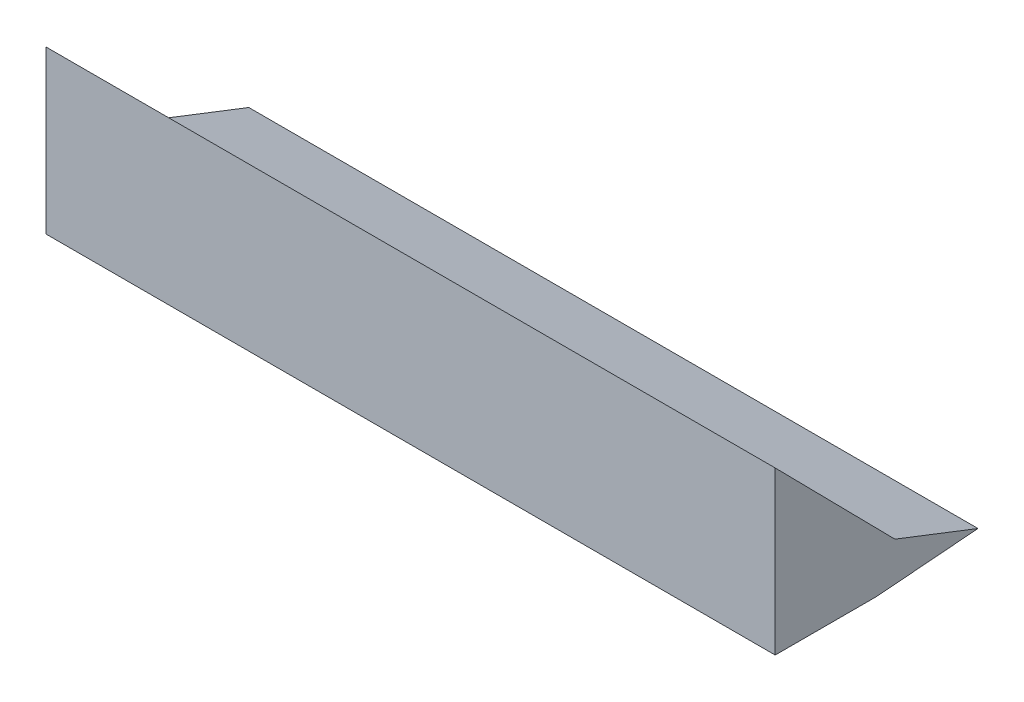
ISO-10303-21;
HEADER;
FILE_DESCRIPTION(('STEP AP214'),'2;1');
FILE_NAME('part.step','',(''),(''),'','','');
FILE_SCHEMA(('AUTOMOTIVE_DESIGN { 1 0 10303 214 1 1 1 1 }'));
ENDSEC;
DATA;
#1=APPLICATION_CONTEXT('core data for automotive mechanical design processes');
#2=APPLICATION_PROTOCOL_DEFINITION('international standard','automotive_design',2000,#1);
#3=PRODUCT_CONTEXT('',#1,'mechanical');
#4=PRODUCT('Part','Part','',(#3));
#5=PRODUCT_RELATED_PRODUCT_CATEGORY('part','',(#4));
#6=PRODUCT_DEFINITION_FORMATION('','',#4);
#7=PRODUCT_DEFINITION_CONTEXT('part definition',#1,'design');
#8=PRODUCT_DEFINITION('design','',#6,#7);
#9=PRODUCT_DEFINITION_SHAPE('','',#8);
#10=(LENGTH_UNIT() NAMED_UNIT(*) SI_UNIT(.MILLI.,.METRE.));
#11=(NAMED_UNIT(*) PLANE_ANGLE_UNIT() SI_UNIT($,.RADIAN.));
#12=(NAMED_UNIT(*) SI_UNIT($,.STERADIAN.) SOLID_ANGLE_UNIT());
#13=UNCERTAINTY_MEASURE_WITH_UNIT(LENGTH_MEASURE(1.E-05),#10,'distance_accuracy_value','');
#14=(GEOMETRIC_REPRESENTATION_CONTEXT(3) GLOBAL_UNCERTAINTY_ASSIGNED_CONTEXT((#13)) GLOBAL_UNIT_ASSIGNED_CONTEXT((#10,
#11,#12)) REPRESENTATION_CONTEXT('',''));
#15=CARTESIAN_POINT('',(0.,0.,0.));
#16=DIRECTION('',(0.,0.,1.));
#17=DIRECTION('',(1.,0.,0.));
#18=AXIS2_PLACEMENT_3D('',#15,#16,#17);
#19=CARTESIAN_POINT('',(180.,10.,-29.5554481427807));
#20=DIRECTION('',(0.,-0.701809028359898,0.712365136508333));
#21=DIRECTION('',(0.,-0.712365136508333,-0.701809028359898));
#22=AXIS2_PLACEMENT_3D('',#19,#20,#21);
#23=PLANE('',#22);
#24=DIRECTION('',(0.,0.712365136508333,0.701809028359898));
#25=VECTOR('',#24,1.);
#26=CARTESIAN_POINT('',(0.,10.,-29.5554481427807));
#27=LINE('',#26,#25);
#28=CARTESIAN_POINT('',(0.,10.,-29.5554481427807));
#29=VERTEX_POINT('',#28);
#30=CARTESIAN_POINT('',(0.,40.,0.));
#31=VERTEX_POINT('',#30);
#32=EDGE_CURVE('E122',#29,#31,#27,.T.);
#33=ORIENTED_EDGE('',*,*,#32,.T.);
#34=DIRECTION('',(-1.,0.,0.));
#35=VECTOR('',#34,1.);
#36=CARTESIAN_POINT('',(180.,40.,0.));
#37=LINE('',#36,#35);
#38=CARTESIAN_POINT('',(180.,40.,0.));
#39=VERTEX_POINT('',#38);
#40=EDGE_CURVE('E11',#39,#31,#37,.T.);
#41=ORIENTED_EDGE('',*,*,#40,.F.);
#42=DIRECTION('',(0.,0.712365136508333,0.701809028359898));
#43=VECTOR('',#42,1.);
#44=CARTESIAN_POINT('',(180.,10.,-29.5554481427807));
#45=LINE('',#44,#43);
#46=CARTESIAN_POINT('',(180.,10.,-29.5554481427807));
#47=VERTEX_POINT('',#46);
#48=EDGE_CURVE('E135',#47,#39,#45,.T.);
#49=ORIENTED_EDGE('',*,*,#48,.F.);
#50=DIRECTION('',(-1.,0.,0.));
#51=VECTOR('',#50,1.);
#52=CARTESIAN_POINT('',(180.,10.,-29.5554481427807));
#53=LINE('',#52,#51);
#54=EDGE_CURVE('E118',#47,#29,#53,.T.);
#55=ORIENTED_EDGE('',*,*,#54,.T.);
#56=EDGE_LOOP('',(#33,#41,#49,#55));
#57=FACE_BOUND('',#56,.T.);
#58=ADVANCED_FACE('F43',(#57),#23,.F.);
#59=CARTESIAN_POINT('',(180.,0.,0.));
#60=DIRECTION('',(0.,0.,-1.));
#61=DIRECTION('',(-1.,0.,0.));
#62=AXIS2_PLACEMENT_3D('',#59,#60,#61);
#63=PLANE('',#62);
#64=DIRECTION('',(0.,-1.,0.));
#65=VECTOR('',#64,1.);
#66=CARTESIAN_POINT('',(0.,0.,0.));
#67=LINE('',#66,#65);
#68=CARTESIAN_POINT('',(0.,0.,0.));
#69=VERTEX_POINT('',#68);
#70=EDGE_CURVE('E126',#31,#69,#67,.T.);
#71=ORIENTED_EDGE('',*,*,#70,.T.);
#72=DIRECTION('',(-1.,0.,0.));
#73=VECTOR('',#72,1.);
#74=CARTESIAN_POINT('',(180.,0.,0.));
#75=LINE('',#74,#73);
#76=CARTESIAN_POINT('',(180.,0.,0.));
#77=VERTEX_POINT('',#76);
#78=EDGE_CURVE('E52',#77,#69,#75,.T.);
#79=ORIENTED_EDGE('',*,*,#78,.F.);
#80=DIRECTION('',(0.,-1.,0.));
#81=VECTOR('',#80,1.);
#82=CARTESIAN_POINT('',(180.,0.,0.));
#83=LINE('',#82,#81);
#84=EDGE_CURVE('E94',#39,#77,#83,.T.);
#85=ORIENTED_EDGE('',*,*,#84,.F.);
#86=ORIENTED_EDGE('',*,*,#40,.T.);
#87=EDGE_LOOP('',(#71,#79,#85,#86));
#88=FACE_BOUND('',#87,.T.);
#89=ADVANCED_FACE('F157',(#88),#63,.F.);
#90=CARTESIAN_POINT('',(180.,0.,0.));
#91=DIRECTION('',(0.,1.,0.));
#92=DIRECTION('',(0.,0.,1.));
#93=AXIS2_PLACEMENT_3D('',#90,#91,#92);
#94=PLANE('',#93);
#95=DIRECTION('',(0.,0.,-1.));
#96=VECTOR('',#95,1.);
#97=CARTESIAN_POINT('',(0.,0.,0.));
#98=LINE('',#97,#96);
#99=CARTESIAN_POINT('',(0.,0.,-25.));
#100=VERTEX_POINT('',#99);
#101=EDGE_CURVE('E110',#69,#100,#98,.T.);
#102=ORIENTED_EDGE('',*,*,#101,.T.);
#103=DIRECTION('',(-1.,0.,0.));
#104=VECTOR('',#103,1.);
#105=CARTESIAN_POINT('',(180.,0.,-25.));
#106=LINE('',#105,#104);
#107=CARTESIAN_POINT('',(180.,0.,-25.));
#108=VERTEX_POINT('',#107);
#109=EDGE_CURVE('E107',#108,#100,#106,.T.);
#110=ORIENTED_EDGE('',*,*,#109,.F.);
#111=DIRECTION('',(0.,0.,-1.));
#112=VECTOR('',#111,1.);
#113=CARTESIAN_POINT('',(180.,0.,0.));
#114=LINE('',#113,#112);
#115=EDGE_CURVE('E98',#77,#108,#114,.T.);
#116=ORIENTED_EDGE('',*,*,#115,.F.);
#117=ORIENTED_EDGE('',*,*,#78,.T.);
#118=EDGE_LOOP('',(#102,#110,#116,#117));
#119=FACE_BOUND('',#118,.T.);
#120=ADVANCED_FACE('F108',(#119),#94,.F.);
#121=CARTESIAN_POINT('',(180.,0.,-25.));
#122=DIRECTION('',(0.,0.996742875644317,0.0806451477294036));
#123=DIRECTION('',(0.,-0.0806451477294036,0.996742875644317));
#124=AXIS2_PLACEMENT_3D('',#121,#122,#123);
#125=PLANE('',#124);
#126=DIRECTION('',(0.,0.0806451477294036,-0.996742875644317));
#127=VECTOR('',#126,1.);
#128=CARTESIAN_POINT('',(0.,0.,-25.));
#129=LINE('',#128,#127);
#130=CARTESIAN_POINT('',(0.,2.02757906522604,-50.0600940660533));
#131=VERTEX_POINT('',#130);
#132=EDGE_CURVE('E80',#100,#131,#129,.T.);
#133=ORIENTED_EDGE('',*,*,#132,.T.);
#134=DIRECTION('',(-1.,0.,0.));
#135=VECTOR('',#134,1.);
#136=CARTESIAN_POINT('',(180.,2.02757906522604,-50.0600940660533));
#137=LINE('',#136,#135);
#138=CARTESIAN_POINT('',(180.,2.02757906522604,-50.0600940660533));
#139=VERTEX_POINT('',#138);
#140=EDGE_CURVE('E112',#139,#131,#137,.T.);
#141=ORIENTED_EDGE('',*,*,#140,.F.);
#142=DIRECTION('',(0.,0.0806451477294036,-0.996742875644317));
#143=VECTOR('',#142,1.);
#144=CARTESIAN_POINT('',(180.,0.,-25.));
#145=LINE('',#144,#143);
#146=EDGE_CURVE('E102',#108,#139,#145,.T.);
#147=ORIENTED_EDGE('',*,*,#146,.F.);
#148=ORIENTED_EDGE('',*,*,#109,.T.);
#149=EDGE_LOOP('',(#133,#141,#147,#148));
#150=FACE_BOUND('',#149,.T.);
#151=ADVANCED_FACE('F114',(#150),#125,.F.);
#152=CARTESIAN_POINT('',(180.,2.02757906522604,-50.0600940660533));
#153=DIRECTION('',(0.,-0.932029360148752,0.362382769762453));
#154=DIRECTION('',(0.,-0.362382769762453,-0.932029360148753));
#155=AXIS2_PLACEMENT_3D('',#152,#153,#154);
#156=PLANE('',#155);
#157=DIRECTION('',(0.,0.362382769762453,0.932029360148753));
#158=VECTOR('',#157,1.);
#159=CARTESIAN_POINT('',(0.,2.02757906522604,-50.0600940660533));
#160=LINE('',#159,#158);
#161=EDGE_CURVE('E86',#131,#29,#160,.T.);
#162=ORIENTED_EDGE('',*,*,#161,.T.);
#163=ORIENTED_EDGE('',*,*,#54,.F.);
#164=DIRECTION('',(0.,0.362382769762453,0.932029360148753));
#165=VECTOR('',#164,1.);
#166=CARTESIAN_POINT('',(180.,2.02757906522604,-50.0600940660533));
#167=LINE('',#166,#165);
#168=EDGE_CURVE('E60',#139,#47,#167,.T.);
#169=ORIENTED_EDGE('',*,*,#168,.F.);
#170=ORIENTED_EDGE('',*,*,#140,.T.);
#171=EDGE_LOOP('',(#162,#163,#169,#170));
#172=FACE_BOUND('',#171,.T.);
#173=ADVANCED_FACE('F146',(#172),#156,.F.);
#174=CARTESIAN_POINT('',(180.,0.,0.));
#175=DIRECTION('',(-1.,0.,0.));
#176=DIRECTION('',(0.,0.,1.));
#177=AXIS2_PLACEMENT_3D('',#174,#175,#176);
#178=PLANE('',#177);
#179=ORIENTED_EDGE('',*,*,#48,.T.);
#180=ORIENTED_EDGE('',*,*,#84,.T.);
#181=ORIENTED_EDGE('',*,*,#115,.T.);
#182=ORIENTED_EDGE('',*,*,#146,.T.);
#183=ORIENTED_EDGE('',*,*,#168,.T.);
#184=EDGE_LOOP('',(#179,#180,#181,#182,#183));
#185=FACE_BOUND('',#184,.T.);
#186=ADVANCED_FACE('F100',(#185),#178,.F.);
#187=CARTESIAN_POINT('',(0.,0.,0.));
#188=DIRECTION('',(-1.,0.,0.));
#189=DIRECTION('',(0.,0.,1.));
#190=AXIS2_PLACEMENT_3D('',#187,#188,#189);
#191=PLANE('',#190);
#192=ORIENTED_EDGE('',*,*,#32,.F.);
#193=ORIENTED_EDGE('',*,*,#161,.F.);
#194=ORIENTED_EDGE('',*,*,#132,.F.);
#195=ORIENTED_EDGE('',*,*,#101,.F.);
#196=ORIENTED_EDGE('',*,*,#70,.F.);
#197=EDGE_LOOP('',(#192,#193,#194,#195,#196));
#198=FACE_BOUND('',#197,.T.);
#199=ADVANCED_FACE('F142',(#198),#191,.T.);
#200=CLOSED_SHELL('',(#58,#89,#120,#151,#173,#186,#199));
#201=MANIFOLD_SOLID_BREP('B2',#200);
#202=ADVANCED_BREP_SHAPE_REPRESENTATION('',(#18,#201),#14);
#203=SHAPE_DEFINITION_REPRESENTATION(#9,#202);
ENDSEC;
END-ISO-10303-21;
